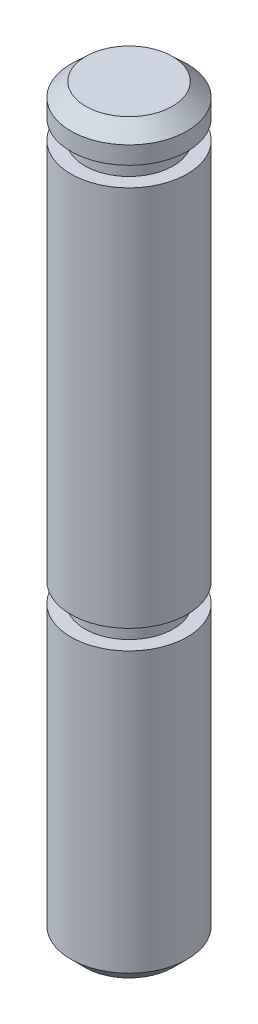
ISO-10303-21;
HEADER;
FILE_DESCRIPTION(('STEP AP214'),'2;1');
FILE_NAME('part.step','',(''),(''),'','','');
FILE_SCHEMA(('AUTOMOTIVE_DESIGN { 1 0 10303 214 1 1 1 1 }'));
ENDSEC;
DATA;
#1=APPLICATION_CONTEXT('core data for automotive mechanical design processes');
#2=APPLICATION_PROTOCOL_DEFINITION('international standard','automotive_design',2000,#1);
#3=PRODUCT_CONTEXT('',#1,'mechanical');
#4=PRODUCT('Part','Part','',(#3));
#5=PRODUCT_RELATED_PRODUCT_CATEGORY('part','',(#4));
#6=PRODUCT_DEFINITION_FORMATION('','',#4);
#7=PRODUCT_DEFINITION_CONTEXT('part definition',#1,'design');
#8=PRODUCT_DEFINITION('design','',#6,#7);
#9=PRODUCT_DEFINITION_SHAPE('','',#8);
#10=(LENGTH_UNIT() NAMED_UNIT(*) SI_UNIT(.MILLI.,.METRE.));
#11=(NAMED_UNIT(*) PLANE_ANGLE_UNIT() SI_UNIT($,.RADIAN.));
#12=(NAMED_UNIT(*) SI_UNIT($,.STERADIAN.) SOLID_ANGLE_UNIT());
#13=UNCERTAINTY_MEASURE_WITH_UNIT(LENGTH_MEASURE(1.E-05),#10,'distance_accuracy_value','');
#14=(GEOMETRIC_REPRESENTATION_CONTEXT(3) GLOBAL_UNCERTAINTY_ASSIGNED_CONTEXT((#13)) GLOBAL_UNIT_ASSIGNED_CONTEXT((#10,
#11,#12)) REPRESENTATION_CONTEXT('',''));
#15=CARTESIAN_POINT('',(0.,0.,0.));
#16=DIRECTION('',(0.,0.,1.));
#17=DIRECTION('',(1.,0.,0.));
#18=AXIS2_PLACEMENT_3D('',#15,#16,#17);
#19=CARTESIAN_POINT('',(-1.2065,-13.7414,0.));
#20=DIRECTION('',(0.,1.,0.));
#21=DIRECTION('',(0.,0.,1.));
#22=AXIS2_PLACEMENT_3D('',#19,#20,#21);
#23=PLANE('',#22);
#24=CARTESIAN_POINT('',(0.,-13.7414,0.));
#25=DIRECTION('',(0.,-1.,0.));
#26=DIRECTION('',(0.,0.,-1.));
#27=AXIS2_PLACEMENT_3D('',#24,#25,#26);
#28=CIRCLE('',#27,1.2065);
#29=CARTESIAN_POINT('',(0.,-13.7414,-1.2065));
#30=VERTEX_POINT('',#29);
#31=EDGE_CURVE('E10',#30,#30,#28,.T.);
#32=ORIENTED_EDGE('',*,*,#31,.T.);
#33=EDGE_LOOP('',(#32));
#34=FACE_BOUND('',#33,.T.);
#35=ADVANCED_FACE('F32',(#34),#23,.F.);
#36=CARTESIAN_POINT('',(0.,-13.3604,0.));
#37=DIRECTION('',(0.,1.,0.));
#38=DIRECTION('',(0.,0.,1.));
#39=AXIS2_PLACEMENT_3D('',#36,#37,#38);
#40=CONICAL_SURFACE('',#39,1.5875,0.78539816339745);
#41=ORIENTED_EDGE('',*,*,#31,.F.);
#42=EDGE_LOOP('',(#41));
#43=FACE_BOUND('',#42,.T.);
#44=CARTESIAN_POINT('',(0.,-13.3604,0.));
#45=DIRECTION('',(0.,-1.,0.));
#46=DIRECTION('',(0.,0.,-1.));
#47=AXIS2_PLACEMENT_3D('',#44,#45,#46);
#48=CIRCLE('',#47,1.5875);
#49=CARTESIAN_POINT('',(0.,-13.3604,-1.5875));
#50=VERTEX_POINT('',#49);
#51=EDGE_CURVE('E38',#50,#50,#48,.T.);
#52=ORIENTED_EDGE('',*,*,#51,.T.);
#53=EDGE_LOOP('',(#52));
#54=FACE_BOUND('',#53,.T.);
#55=ADVANCED_FACE('F88',(#43,#54),#40,.T.);
#56=CARTESIAN_POINT('',(0.,0.,0.));
#57=DIRECTION('',(0.,-1.,0.));
#58=DIRECTION('',(0.,0.,-1.));
#59=AXIS2_PLACEMENT_3D('',#56,#57,#58);
#60=CYLINDRICAL_SURFACE('',#59,1.5875);
#61=ORIENTED_EDGE('',*,*,#51,.F.);
#62=EDGE_LOOP('',(#61));
#63=FACE_BOUND('',#62,.T.);
#64=CARTESIAN_POINT('',(0.,-5.7404,0.));
#65=DIRECTION('',(0.,-1.,0.));
#66=DIRECTION('',(0.,0.,-1.));
#67=AXIS2_PLACEMENT_3D('',#64,#65,#66);
#68=CIRCLE('',#67,1.5875);
#69=CARTESIAN_POINT('',(0.,-5.7404,-1.5875));
#70=VERTEX_POINT('',#69);
#71=EDGE_CURVE('E42',#70,#70,#68,.T.);
#72=ORIENTED_EDGE('',*,*,#71,.T.);
#73=EDGE_LOOP('',(#72));
#74=FACE_BOUND('',#73,.T.);
#75=ADVANCED_FACE('F92',(#63,#74),#60,.T.);
#76=CARTESIAN_POINT('',(-1.2065,-5.7404,0.));
#77=DIRECTION('',(0.,-1.,0.));
#78=DIRECTION('',(0.,0.,-1.));
#79=AXIS2_PLACEMENT_3D('',#76,#77,#78);
#80=PLANE('',#79);
#81=ORIENTED_EDGE('',*,*,#71,.F.);
#82=EDGE_LOOP('',(#81));
#83=FACE_BOUND('',#82,.T.);
#84=CARTESIAN_POINT('',(0.,-5.7404,0.));
#85=DIRECTION('',(0.,-1.,0.));
#86=DIRECTION('',(0.,0.,-1.));
#87=AXIS2_PLACEMENT_3D('',#84,#85,#86);
#88=CIRCLE('',#87,1.2065);
#89=CARTESIAN_POINT('',(0.,-5.7404,-1.2065));
#90=VERTEX_POINT('',#89);
#91=EDGE_CURVE('E46',#90,#90,#88,.T.);
#92=ORIENTED_EDGE('',*,*,#91,.T.);
#93=EDGE_LOOP('',(#92));
#94=FACE_BOUND('',#93,.T.);
#95=ADVANCED_FACE('F97',(#83,#94),#80,.F.);
#96=CARTESIAN_POINT('',(0.,0.,0.));
#97=DIRECTION('',(0.,-1.,0.));
#98=DIRECTION('',(0.,0.,-1.));
#99=AXIS2_PLACEMENT_3D('',#96,#97,#98);
#100=CYLINDRICAL_SURFACE('',#99,1.2065);
#101=ORIENTED_EDGE('',*,*,#91,.F.);
#102=EDGE_LOOP('',(#101));
#103=FACE_BOUND('',#102,.T.);
#104=CARTESIAN_POINT('',(0.,-5.207,0.));
#105=DIRECTION('',(0.,-1.,0.));
#106=DIRECTION('',(0.,0.,-1.));
#107=AXIS2_PLACEMENT_3D('',#104,#105,#106);
#108=CIRCLE('',#107,1.2065);
#109=CARTESIAN_POINT('',(0.,-5.207,-1.2065));
#110=VERTEX_POINT('',#109);
#111=EDGE_CURVE('E51',#110,#110,#108,.T.);
#112=ORIENTED_EDGE('',*,*,#111,.T.);
#113=EDGE_LOOP('',(#112));
#114=FACE_BOUND('',#113,.T.);
#115=ADVANCED_FACE('F103',(#103,#114),#100,.T.);
#116=CARTESIAN_POINT('',(-1.5875,-5.207,0.));
#117=DIRECTION('',(0.,1.,0.));
#118=DIRECTION('',(0.,0.,1.));
#119=AXIS2_PLACEMENT_3D('',#116,#117,#118);
#120=PLANE('',#119);
#121=ORIENTED_EDGE('',*,*,#111,.F.);
#122=EDGE_LOOP('',(#121));
#123=FACE_BOUND('',#122,.T.);
#124=CARTESIAN_POINT('',(0.,-5.207,0.));
#125=DIRECTION('',(0.,-1.,0.));
#126=DIRECTION('',(0.,0.,-1.));
#127=AXIS2_PLACEMENT_3D('',#124,#125,#126);
#128=CIRCLE('',#127,1.5875);
#129=CARTESIAN_POINT('',(0.,-5.207,-1.5875));
#130=VERTEX_POINT('',#129);
#131=EDGE_CURVE('E54',#130,#130,#128,.T.);
#132=ORIENTED_EDGE('',*,*,#131,.T.);
#133=EDGE_LOOP('',(#132));
#134=FACE_BOUND('',#133,.T.);
#135=ADVANCED_FACE('F107',(#123,#134),#120,.F.);
#136=CARTESIAN_POINT('',(0.,0.,0.));
#137=DIRECTION('',(0.,-1.,0.));
#138=DIRECTION('',(0.,0.,-1.));
#139=AXIS2_PLACEMENT_3D('',#136,#137,#138);
#140=CYLINDRICAL_SURFACE('',#139,1.5875);
#141=ORIENTED_EDGE('',*,*,#131,.F.);
#142=EDGE_LOOP('',(#141));
#143=FACE_BOUND('',#142,.T.);
#144=CARTESIAN_POINT('',(0.,5.207,0.));
#145=DIRECTION('',(0.,-1.,0.));
#146=DIRECTION('',(0.,0.,-1.));
#147=AXIS2_PLACEMENT_3D('',#144,#145,#146);
#148=CIRCLE('',#147,1.5875);
#149=CARTESIAN_POINT('',(0.,5.207,-1.5875));
#150=VERTEX_POINT('',#149);
#151=EDGE_CURVE('E57',#150,#150,#148,.T.);
#152=ORIENTED_EDGE('',*,*,#151,.T.);
#153=EDGE_LOOP('',(#152));
#154=FACE_BOUND('',#153,.T.);
#155=ADVANCED_FACE('F111',(#143,#154),#140,.T.);
#156=CARTESIAN_POINT('',(-1.5875,5.207,0.));
#157=DIRECTION('',(0.,-1.,0.));
#158=DIRECTION('',(0.,0.,-1.));
#159=AXIS2_PLACEMENT_3D('',#156,#157,#158);
#160=PLANE('',#159);
#161=ORIENTED_EDGE('',*,*,#151,.F.);
#162=EDGE_LOOP('',(#161));
#163=FACE_BOUND('',#162,.T.);
#164=CARTESIAN_POINT('',(0.,5.207,0.));
#165=DIRECTION('',(0.,-1.,0.));
#166=DIRECTION('',(0.,0.,-1.));
#167=AXIS2_PLACEMENT_3D('',#164,#165,#166);
#168=CIRCLE('',#167,1.2065);
#169=CARTESIAN_POINT('',(0.,5.207,-1.2065));
#170=VERTEX_POINT('',#169);
#171=EDGE_CURVE('E60',#170,#170,#168,.T.);
#172=ORIENTED_EDGE('',*,*,#171,.T.);
#173=EDGE_LOOP('',(#172));
#174=FACE_BOUND('',#173,.T.);
#175=ADVANCED_FACE('F115',(#163,#174),#160,.F.);
#176=CARTESIAN_POINT('',(0.,0.,0.));
#177=DIRECTION('',(0.,-1.,0.));
#178=DIRECTION('',(0.,0.,-1.));
#179=AXIS2_PLACEMENT_3D('',#176,#177,#178);
#180=CYLINDRICAL_SURFACE('',#179,1.2065);
#181=ORIENTED_EDGE('',*,*,#171,.F.);
#182=EDGE_LOOP('',(#181));
#183=FACE_BOUND('',#182,.T.);
#184=CARTESIAN_POINT('',(0.,5.7404,0.));
#185=DIRECTION('',(0.,-1.,0.));
#186=DIRECTION('',(0.,0.,-1.));
#187=AXIS2_PLACEMENT_3D('',#184,#185,#186);
#188=CIRCLE('',#187,1.2065);
#189=CARTESIAN_POINT('',(0.,5.7404,-1.2065));
#190=VERTEX_POINT('',#189);
#191=EDGE_CURVE('E63',#190,#190,#188,.T.);
#192=ORIENTED_EDGE('',*,*,#191,.T.);
#193=EDGE_LOOP('',(#192));
#194=FACE_BOUND('',#193,.T.);
#195=ADVANCED_FACE('F119',(#183,#194),#180,.T.);
#196=CARTESIAN_POINT('',(-1.2065,5.7404,0.));
#197=DIRECTION('',(0.,1.,0.));
#198=DIRECTION('',(0.,0.,1.));
#199=AXIS2_PLACEMENT_3D('',#196,#197,#198);
#200=PLANE('',#199);
#201=ORIENTED_EDGE('',*,*,#191,.F.);
#202=EDGE_LOOP('',(#201));
#203=FACE_BOUND('',#202,.T.);
#204=CARTESIAN_POINT('',(0.,5.7404,0.));
#205=DIRECTION('',(0.,-1.,0.));
#206=DIRECTION('',(0.,0.,-1.));
#207=AXIS2_PLACEMENT_3D('',#204,#205,#206);
#208=CIRCLE('',#207,1.5875);
#209=CARTESIAN_POINT('',(0.,5.7404,-1.5875));
#210=VERTEX_POINT('',#209);
#211=EDGE_CURVE('E66',#210,#210,#208,.T.);
#212=ORIENTED_EDGE('',*,*,#211,.T.);
#213=EDGE_LOOP('',(#212));
#214=FACE_BOUND('',#213,.T.);
#215=ADVANCED_FACE('F123',(#203,#214),#200,.F.);
#216=CARTESIAN_POINT('',(0.,0.,0.));
#217=DIRECTION('',(0.,-1.,0.));
#218=DIRECTION('',(0.,0.,-1.));
#219=AXIS2_PLACEMENT_3D('',#216,#217,#218);
#220=CYLINDRICAL_SURFACE('',#219,1.5875);
#221=ORIENTED_EDGE('',*,*,#211,.F.);
#222=EDGE_LOOP('',(#221));
#223=FACE_BOUND('',#222,.T.);
#224=CARTESIAN_POINT('',(0.,6.223,0.));
#225=DIRECTION('',(0.,-1.,0.));
#226=DIRECTION('',(0.,0.,-1.));
#227=AXIS2_PLACEMENT_3D('',#224,#225,#226);
#228=CIRCLE('',#227,1.5875);
#229=CARTESIAN_POINT('',(0.,6.223,-1.5875));
#230=VERTEX_POINT('',#229);
#231=EDGE_CURVE('E69',#230,#230,#228,.T.);
#232=ORIENTED_EDGE('',*,*,#231,.T.);
#233=EDGE_LOOP('',(#232));
#234=FACE_BOUND('',#233,.T.);
#235=ADVANCED_FACE('F84',(#223,#234),#220,.T.);
#236=CARTESIAN_POINT('',(0.,6.604,0.));
#237=DIRECTION('',(0.,-1.,0.));
#238=DIRECTION('',(0.,0.,-1.));
#239=AXIS2_PLACEMENT_3D('',#236,#237,#238);
#240=CONICAL_SURFACE('',#239,1.18278756142947,0.815568544068997);
#241=ORIENTED_EDGE('',*,*,#231,.F.);
#242=EDGE_LOOP('',(#241));
#243=FACE_BOUND('',#242,.T.);
#244=CARTESIAN_POINT('',(0.,6.604,0.));
#245=DIRECTION('',(0.,-1.,0.));
#246=DIRECTION('',(0.,0.,-1.));
#247=AXIS2_PLACEMENT_3D('',#244,#245,#246);
#248=CIRCLE('',#247,1.18278756142947);
#249=CARTESIAN_POINT('',(0.,6.604,-1.18278756142947));
#250=VERTEX_POINT('',#249);
#251=EDGE_CURVE('E72',#250,#250,#248,.T.);
#252=ORIENTED_EDGE('',*,*,#251,.T.);
#253=EDGE_LOOP('',(#252));
#254=FACE_BOUND('',#253,.T.);
#255=ADVANCED_FACE('F76',(#243,#254),#240,.T.);
#256=CARTESIAN_POINT('',(-1.18278756142947,6.604,0.));
#257=DIRECTION('',(0.,-1.,0.));
#258=DIRECTION('',(0.,0.,-1.));
#259=AXIS2_PLACEMENT_3D('',#256,#257,#258);
#260=PLANE('',#259);
#261=ORIENTED_EDGE('',*,*,#251,.F.);
#262=EDGE_LOOP('',(#261));
#263=FACE_BOUND('',#262,.T.);
#264=ADVANCED_FACE('F78',(#263),#260,.F.);
#265=CLOSED_SHELL('',(#35,#55,#75,#95,#115,#135,#155,#175,#195,#215,#235,#255,#264));
#266=MANIFOLD_SOLID_BREP('B2',#265);
#267=ADVANCED_BREP_SHAPE_REPRESENTATION('',(#18,#266),#14);
#268=SHAPE_DEFINITION_REPRESENTATION(#9,#267);
ENDSEC;
END-ISO-10303-21;
